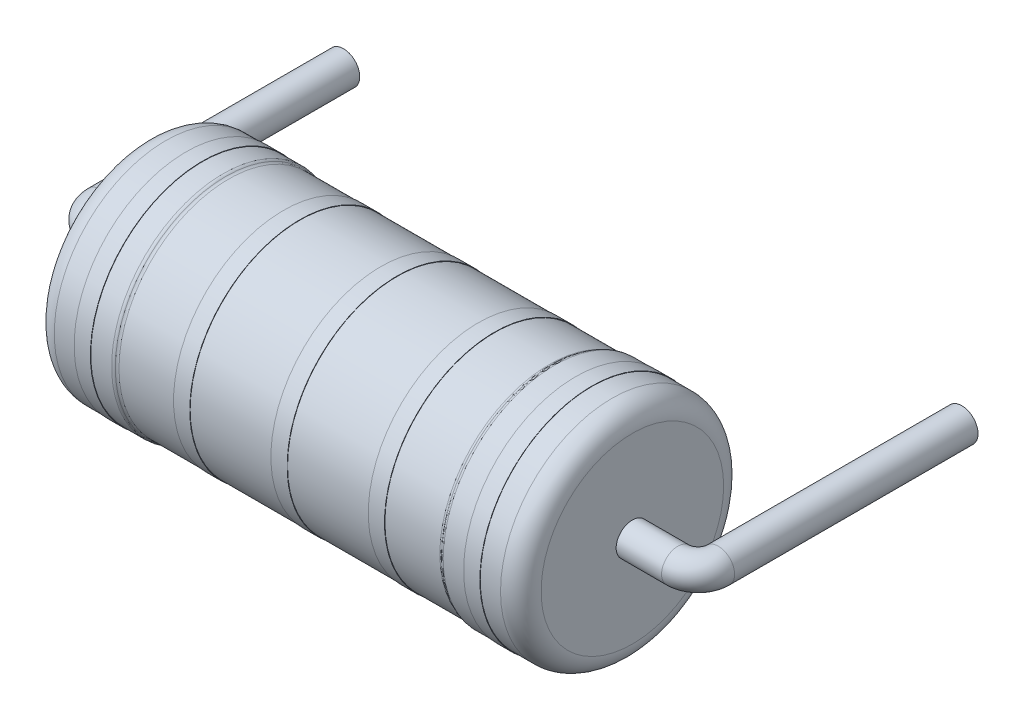
ISO-10303-21;
HEADER;
FILE_DESCRIPTION(('STEP AP214'),'2;1');
FILE_NAME('part.step','',(''),(''),'','','');
FILE_SCHEMA(('AUTOMOTIVE_DESIGN { 1 0 10303 214 1 1 1 1 }'));
ENDSEC;
DATA;
#1=APPLICATION_CONTEXT('core data for automotive mechanical design processes');
#2=APPLICATION_PROTOCOL_DEFINITION('international standard','automotive_design',2000,#1);
#3=PRODUCT_CONTEXT('',#1,'mechanical');
#4=PRODUCT('Part','Part','',(#3));
#5=PRODUCT_RELATED_PRODUCT_CATEGORY('part','',(#4));
#6=PRODUCT_DEFINITION_FORMATION('','',#4);
#7=PRODUCT_DEFINITION_CONTEXT('part definition',#1,'design');
#8=PRODUCT_DEFINITION('design','',#6,#7);
#9=PRODUCT_DEFINITION_SHAPE('','',#8);
#10=(LENGTH_UNIT() NAMED_UNIT(*) SI_UNIT(.MILLI.,.METRE.));
#11=(NAMED_UNIT(*) PLANE_ANGLE_UNIT() SI_UNIT($,.RADIAN.));
#12=(NAMED_UNIT(*) SI_UNIT($,.STERADIAN.) SOLID_ANGLE_UNIT());
#13=UNCERTAINTY_MEASURE_WITH_UNIT(LENGTH_MEASURE(1.E-05),#10,'distance_accuracy_value','');
#14=(GEOMETRIC_REPRESENTATION_CONTEXT(3) GLOBAL_UNCERTAINTY_ASSIGNED_CONTEXT((#13)) GLOBAL_UNIT_ASSIGNED_CONTEXT((#10,
#11,#12)) REPRESENTATION_CONTEXT('',''));
#15=CARTESIAN_POINT('',(0.,0.,0.));
#16=DIRECTION('',(0.,0.,1.));
#17=DIRECTION('',(1.,0.,0.));
#18=AXIS2_PLACEMENT_3D('',#15,#16,#17);
#19=CARTESIAN_POINT('',(0.2,0.,4.5));
#20=DIRECTION('',(-1.,0.,0.));
#21=DIRECTION('',(0.,0.,1.));
#22=AXIS2_PLACEMENT_3D('',#19,#20,#21);
#23=CYLINDRICAL_SURFACE('',#22,2.71);
#24=CARTESIAN_POINT('',(0.2,0.,4.5));
#25=DIRECTION('',(1.,0.,0.));
#26=DIRECTION('',(0.,0.,-1.));
#27=AXIS2_PLACEMENT_3D('',#24,#25,#26);
#28=CIRCLE('',#27,2.71);
#29=CARTESIAN_POINT('',(0.2,0.,1.79));
#30=VERTEX_POINT('',#29);
#31=EDGE_CURVE('E12',#30,#30,#28,.T.);
#32=ORIENTED_EDGE('',*,*,#31,.F.);
#33=EDGE_LOOP('',(#32));
#34=FACE_BOUND('',#33,.T.);
#35=CARTESIAN_POINT('',(-0.2,0.,4.5));
#36=DIRECTION('',(1.,0.,0.));
#37=DIRECTION('',(0.,0.,-1.));
#38=AXIS2_PLACEMENT_3D('',#35,#36,#37);
#39=CIRCLE('',#38,2.71);
#40=CARTESIAN_POINT('',(-0.2,0.,1.79));
#41=VERTEX_POINT('',#40);
#42=EDGE_CURVE('E40',#41,#41,#39,.T.);
#43=ORIENTED_EDGE('',*,*,#42,.T.);
#44=EDGE_LOOP('',(#43));
#45=FACE_BOUND('',#44,.T.);
#46=ADVANCED_FACE('F34',(#34,#45),#23,.T.);
#47=CARTESIAN_POINT('',(0.2,0.,4.5));
#48=DIRECTION('',(1.,0.,0.));
#49=DIRECTION('',(0.,0.,-1.));
#50=AXIS2_PLACEMENT_3D('',#47,#48,#49);
#51=PLANE('',#50);
#52=ORIENTED_EDGE('',*,*,#31,.T.);
#53=EDGE_LOOP('',(#52));
#54=FACE_BOUND('',#53,.T.);
#55=ADVANCED_FACE('F49',(#54),#51,.T.);
#56=CARTESIAN_POINT('',(-0.2,0.,4.5));
#57=DIRECTION('',(1.,0.,0.));
#58=DIRECTION('',(0.,0.,-1.));
#59=AXIS2_PLACEMENT_3D('',#56,#57,#58);
#60=PLANE('',#59);
#61=ORIENTED_EDGE('',*,*,#42,.F.);
#62=EDGE_LOOP('',(#61));
#63=FACE_BOUND('',#62,.T.);
#64=ADVANCED_FACE('F47',(#63),#60,.F.);
#65=CLOSED_SHELL('',(#46,#55,#64));
#66=MANIFOLD_SOLID_BREP('B2',#65);
#67=CARTESIAN_POINT('',(-2.2,0.,4.5));
#68=DIRECTION('',(-1.,0.,0.));
#69=DIRECTION('',(0.,0.,1.));
#70=AXIS2_PLACEMENT_3D('',#67,#68,#69);
#71=CYLINDRICAL_SURFACE('',#70,2.71);
#72=CARTESIAN_POINT('',(-2.2,0.,4.5));
#73=DIRECTION('',(1.,0.,0.));
#74=DIRECTION('',(0.,0.,-1.));
#75=AXIS2_PLACEMENT_3D('',#72,#73,#74);
#76=CIRCLE('',#75,2.71);
#77=CARTESIAN_POINT('',(-2.2,0.,1.79));
#78=VERTEX_POINT('',#77);
#79=EDGE_CURVE('E33',#78,#78,#76,.T.);
#80=ORIENTED_EDGE('',*,*,#79,.F.);
#81=EDGE_LOOP('',(#80));
#82=FACE_BOUND('',#81,.T.);
#83=CARTESIAN_POINT('',(-2.6,0.,4.5));
#84=DIRECTION('',(1.,0.,0.));
#85=DIRECTION('',(0.,0.,-1.));
#86=AXIS2_PLACEMENT_3D('',#83,#84,#85);
#87=CIRCLE('',#86,2.71);
#88=CARTESIAN_POINT('',(-2.6,0.,1.79));
#89=VERTEX_POINT('',#88);
#90=EDGE_CURVE('E82',#89,#89,#87,.T.);
#91=ORIENTED_EDGE('',*,*,#90,.T.);
#92=EDGE_LOOP('',(#91));
#93=FACE_BOUND('',#92,.T.);
#94=ADVANCED_FACE('F76',(#82,#93),#71,.T.);
#95=CARTESIAN_POINT('',(-2.2,0.,4.5));
#96=DIRECTION('',(1.,0.,0.));
#97=DIRECTION('',(0.,0.,-1.));
#98=AXIS2_PLACEMENT_3D('',#95,#96,#97);
#99=PLANE('',#98);
#100=ORIENTED_EDGE('',*,*,#79,.T.);
#101=EDGE_LOOP('',(#100));
#102=FACE_BOUND('',#101,.T.);
#103=ADVANCED_FACE('F91',(#102),#99,.T.);
#104=CARTESIAN_POINT('',(-2.6,0.,4.5));
#105=DIRECTION('',(1.,0.,0.));
#106=DIRECTION('',(0.,0.,-1.));
#107=AXIS2_PLACEMENT_3D('',#104,#105,#106);
#108=PLANE('',#107);
#109=ORIENTED_EDGE('',*,*,#90,.F.);
#110=EDGE_LOOP('',(#109));
#111=FACE_BOUND('',#110,.T.);
#112=ADVANCED_FACE('F89',(#111),#108,.F.);
#113=CLOSED_SHELL('',(#94,#103,#112));
#114=MANIFOLD_SOLID_BREP('B7',#113);
#115=CARTESIAN_POINT('',(2.6,0.,4.5));
#116=DIRECTION('',(-1.,0.,0.));
#117=DIRECTION('',(0.,0.,1.));
#118=AXIS2_PLACEMENT_3D('',#115,#116,#117);
#119=CYLINDRICAL_SURFACE('',#118,2.71);
#120=CARTESIAN_POINT('',(2.6,0.,4.5));
#121=DIRECTION('',(1.,0.,0.));
#122=DIRECTION('',(0.,0.,-1.));
#123=AXIS2_PLACEMENT_3D('',#120,#121,#122);
#124=CIRCLE('',#123,2.71);
#125=CARTESIAN_POINT('',(2.6,0.,1.79));
#126=VERTEX_POINT('',#125);
#127=EDGE_CURVE('E75',#126,#126,#124,.T.);
#128=ORIENTED_EDGE('',*,*,#127,.F.);
#129=EDGE_LOOP('',(#128));
#130=FACE_BOUND('',#129,.T.);
#131=CARTESIAN_POINT('',(2.2,0.,4.5));
#132=DIRECTION('',(1.,0.,0.));
#133=DIRECTION('',(0.,0.,-1.));
#134=AXIS2_PLACEMENT_3D('',#131,#132,#133);
#135=CIRCLE('',#134,2.71);
#136=CARTESIAN_POINT('',(2.2,0.,1.79));
#137=VERTEX_POINT('',#136);
#138=EDGE_CURVE('E124',#137,#137,#135,.T.);
#139=ORIENTED_EDGE('',*,*,#138,.T.);
#140=EDGE_LOOP('',(#139));
#141=FACE_BOUND('',#140,.T.);
#142=ADVANCED_FACE('F118',(#130,#141),#119,.T.);
#143=CARTESIAN_POINT('',(2.6,0.,4.5));
#144=DIRECTION('',(1.,0.,0.));
#145=DIRECTION('',(0.,0.,-1.));
#146=AXIS2_PLACEMENT_3D('',#143,#144,#145);
#147=PLANE('',#146);
#148=ORIENTED_EDGE('',*,*,#127,.T.);
#149=EDGE_LOOP('',(#148));
#150=FACE_BOUND('',#149,.T.);
#151=ADVANCED_FACE('F133',(#150),#147,.T.);
#152=CARTESIAN_POINT('',(2.2,0.,4.5));
#153=DIRECTION('',(1.,0.,0.));
#154=DIRECTION('',(0.,0.,-1.));
#155=AXIS2_PLACEMENT_3D('',#152,#153,#154);
#156=PLANE('',#155);
#157=ORIENTED_EDGE('',*,*,#138,.F.);
#158=EDGE_LOOP('',(#157));
#159=FACE_BOUND('',#158,.T.);
#160=ADVANCED_FACE('F131',(#159),#156,.F.);
#161=CLOSED_SHELL('',(#142,#151,#160));
#162=MANIFOLD_SOLID_BREP('B28',#161);
#163=CARTESIAN_POINT('',(-4.6,0.,4.5));
#164=DIRECTION('',(-1.,0.,0.));
#165=DIRECTION('',(0.,0.,1.));
#166=AXIS2_PLACEMENT_3D('',#163,#164,#165);
#167=CYLINDRICAL_SURFACE('',#166,2.76);
#168=CARTESIAN_POINT('',(-4.6,0.,4.5));
#169=DIRECTION('',(1.,0.,0.));
#170=DIRECTION('',(0.,0.,-1.));
#171=AXIS2_PLACEMENT_3D('',#168,#169,#170);
#172=CIRCLE('',#171,2.76);
#173=CARTESIAN_POINT('',(-4.6,0.,1.74));
#174=VERTEX_POINT('',#173);
#175=EDGE_CURVE('E117',#174,#174,#172,.T.);
#176=ORIENTED_EDGE('',*,*,#175,.F.);
#177=EDGE_LOOP('',(#176));
#178=FACE_BOUND('',#177,.T.);
#179=CARTESIAN_POINT('',(-5.,0.,4.5));
#180=DIRECTION('',(1.,0.,0.));
#181=DIRECTION('',(0.,0.,-1.));
#182=AXIS2_PLACEMENT_3D('',#179,#180,#181);
#183=CIRCLE('',#182,2.76);
#184=CARTESIAN_POINT('',(-5.,0.,1.74));
#185=VERTEX_POINT('',#184);
#186=EDGE_CURVE('E166',#185,#185,#183,.T.);
#187=ORIENTED_EDGE('',*,*,#186,.T.);
#188=EDGE_LOOP('',(#187));
#189=FACE_BOUND('',#188,.T.);
#190=ADVANCED_FACE('F160',(#178,#189),#167,.T.);
#191=CARTESIAN_POINT('',(-4.6,0.,4.5));
#192=DIRECTION('',(1.,0.,0.));
#193=DIRECTION('',(0.,0.,-1.));
#194=AXIS2_PLACEMENT_3D('',#191,#192,#193);
#195=PLANE('',#194);
#196=ORIENTED_EDGE('',*,*,#175,.T.);
#197=EDGE_LOOP('',(#196));
#198=FACE_BOUND('',#197,.T.);
#199=ADVANCED_FACE('F175',(#198),#195,.T.);
#200=CARTESIAN_POINT('',(-5.,0.,4.5));
#201=DIRECTION('',(1.,0.,0.));
#202=DIRECTION('',(0.,0.,-1.));
#203=AXIS2_PLACEMENT_3D('',#200,#201,#202);
#204=PLANE('',#203);
#205=ORIENTED_EDGE('',*,*,#186,.F.);
#206=EDGE_LOOP('',(#205));
#207=FACE_BOUND('',#206,.T.);
#208=ADVANCED_FACE('F173',(#207),#204,.F.);
#209=CLOSED_SHELL('',(#190,#199,#208));
#210=MANIFOLD_SOLID_BREP('B70',#209);
#211=CARTESIAN_POINT('',(5.,0.,4.5));
#212=DIRECTION('',(-1.,0.,0.));
#213=DIRECTION('',(0.,0.,1.));
#214=AXIS2_PLACEMENT_3D('',#211,#212,#213);
#215=CYLINDRICAL_SURFACE('',#214,2.76);
#216=CARTESIAN_POINT('',(5.,0.,4.5));
#217=DIRECTION('',(1.,0.,0.));
#218=DIRECTION('',(0.,0.,-1.));
#219=AXIS2_PLACEMENT_3D('',#216,#217,#218);
#220=CIRCLE('',#219,2.76);
#221=CARTESIAN_POINT('',(5.,0.,1.74));
#222=VERTEX_POINT('',#221);
#223=EDGE_CURVE('E159',#222,#222,#220,.T.);
#224=ORIENTED_EDGE('',*,*,#223,.F.);
#225=EDGE_LOOP('',(#224));
#226=FACE_BOUND('',#225,.T.);
#227=CARTESIAN_POINT('',(4.6,0.,4.5));
#228=DIRECTION('',(1.,0.,0.));
#229=DIRECTION('',(0.,0.,-1.));
#230=AXIS2_PLACEMENT_3D('',#227,#228,#229);
#231=CIRCLE('',#230,2.76);
#232=CARTESIAN_POINT('',(4.6,0.,1.74));
#233=VERTEX_POINT('',#232);
#234=EDGE_CURVE('E207',#233,#233,#231,.T.);
#235=ORIENTED_EDGE('',*,*,#234,.T.);
#236=EDGE_LOOP('',(#235));
#237=FACE_BOUND('',#236,.T.);
#238=ADVANCED_FACE('F201',(#226,#237),#215,.T.);
#239=CARTESIAN_POINT('',(5.,0.,4.5));
#240=DIRECTION('',(1.,0.,0.));
#241=DIRECTION('',(0.,0.,-1.));
#242=AXIS2_PLACEMENT_3D('',#239,#240,#241);
#243=PLANE('',#242);
#244=ORIENTED_EDGE('',*,*,#223,.T.);
#245=EDGE_LOOP('',(#244));
#246=FACE_BOUND('',#245,.T.);
#247=ADVANCED_FACE('F216',(#246),#243,.T.);
#248=CARTESIAN_POINT('',(4.6,0.,4.5));
#249=DIRECTION('',(1.,0.,0.));
#250=DIRECTION('',(0.,0.,-1.));
#251=AXIS2_PLACEMENT_3D('',#248,#249,#250);
#252=PLANE('',#251);
#253=ORIENTED_EDGE('',*,*,#234,.F.);
#254=EDGE_LOOP('',(#253));
#255=FACE_BOUND('',#254,.T.);
#256=ADVANCED_FACE('F214',(#255),#252,.F.);
#257=CLOSED_SHELL('',(#238,#247,#256));
#258=MANIFOLD_SOLID_BREP('B112',#257);
#259=CARTESIAN_POINT('',(6.,0.,4.5));
#260=DIRECTION('',(1.,0.,0.));
#261=DIRECTION('',(0.,0.,-1.));
#262=AXIS2_PLACEMENT_3D('',#259,#260,#261);
#263=PLANE('',#262);
#264=CARTESIAN_POINT('',(6.,0.,4.5));
#265=DIRECTION('',(1.,0.,0.));
#266=DIRECTION('',(0.,0.,-1.));
#267=AXIS2_PLACEMENT_3D('',#264,#265,#266);
#268=CIRCLE('',#267,2.25);
#269=CARTESIAN_POINT('',(6.,0.,2.25));
#270=VERTEX_POINT('',#269);
#271=EDGE_CURVE('E250',#270,#270,#268,.T.);
#272=ORIENTED_EDGE('',*,*,#271,.T.);
#273=EDGE_LOOP('',(#272));
#274=FACE_BOUND('',#273,.T.);
#275=CARTESIAN_POINT('',(6.,0.,4.5));
#276=DIRECTION('',(1.,0.,0.));
#277=DIRECTION('',(0.,0.,-1.));
#278=AXIS2_PLACEMENT_3D('',#275,#276,#277);
#279=CIRCLE('',#278,0.4);
#280=CARTESIAN_POINT('',(6.,0.,4.1));
#281=VERTEX_POINT('',#280);
#282=EDGE_CURVE('E294',#281,#281,#279,.T.);
#283=ORIENTED_EDGE('',*,*,#282,.F.);
#284=EDGE_LOOP('',(#283));
#285=FACE_BOUND('',#284,.T.);
#286=ADVANCED_FACE('F235',(#274,#285),#263,.T.);
#287=CARTESIAN_POINT('',(6.,0.,4.5));
#288=DIRECTION('',(-1.,0.,0.));
#289=DIRECTION('',(0.,0.,1.));
#290=AXIS2_PLACEMENT_3D('',#287,#288,#289);
#291=CYLINDRICAL_SURFACE('',#290,2.75);
#292=CARTESIAN_POINT('',(-5.5,0.,4.5));
#293=DIRECTION('',(1.,0.,0.));
#294=DIRECTION('',(0.,0.,-1.));
#295=AXIS2_PLACEMENT_3D('',#292,#293,#294);
#296=CIRCLE('',#295,2.75);
#297=CARTESIAN_POINT('',(-5.5,0.,1.75));
#298=VERTEX_POINT('',#297);
#299=EDGE_CURVE('E242',#298,#298,#296,.T.);
#300=ORIENTED_EDGE('',*,*,#299,.T.);
#301=EDGE_LOOP('',(#300));
#302=FACE_BOUND('',#301,.T.);
#303=CARTESIAN_POINT('',(-4.08660254037844,0.,4.5));
#304=DIRECTION('',(1.,0.,0.));
#305=DIRECTION('',(0.,0.,-1.));
#306=AXIS2_PLACEMENT_3D('',#303,#304,#305);
#307=CIRCLE('',#306,2.75);
#308=CARTESIAN_POINT('',(-4.08660254037844,0.,1.75));
#309=VERTEX_POINT('',#308);
#310=EDGE_CURVE('E270',#309,#309,#307,.F.);
#311=ORIENTED_EDGE('',*,*,#310,.T.);
#312=EDGE_LOOP('',(#311));
#313=FACE_BOUND('',#312,.T.);
#314=ADVANCED_FACE('F301',(#302,#313),#291,.T.);
#315=CARTESIAN_POINT('',(-6.,0.,4.5));
#316=DIRECTION('',(1.,0.,0.));
#317=DIRECTION('',(0.,0.,-1.));
#318=AXIS2_PLACEMENT_3D('',#315,#316,#317);
#319=PLANE('',#318);
#320=CARTESIAN_POINT('',(-6.,0.,4.5));
#321=DIRECTION('',(1.,0.,0.));
#322=DIRECTION('',(0.,0.,-1.));
#323=AXIS2_PLACEMENT_3D('',#320,#321,#322);
#324=CIRCLE('',#323,0.4);
#325=CARTESIAN_POINT('',(-6.,0.,4.1));
#326=VERTEX_POINT('',#325);
#327=EDGE_CURVE('E282',#326,#326,#324,.T.);
#328=ORIENTED_EDGE('',*,*,#327,.T.);
#329=EDGE_LOOP('',(#328));
#330=FACE_BOUND('',#329,.T.);
#331=CARTESIAN_POINT('',(-6.,0.,4.5));
#332=DIRECTION('',(1.,0.,0.));
#333=DIRECTION('',(0.,0.,-1.));
#334=AXIS2_PLACEMENT_3D('',#331,#332,#333);
#335=CIRCLE('',#334,2.25);
#336=CARTESIAN_POINT('',(-6.,0.,2.25));
#337=VERTEX_POINT('',#336);
#338=EDGE_CURVE('E200',#337,#337,#335,.F.);
#339=ORIENTED_EDGE('',*,*,#338,.T.);
#340=EDGE_LOOP('',(#339));
#341=FACE_BOUND('',#340,.T.);
#342=ADVANCED_FACE('F308',(#330,#341),#319,.F.);
#343=CARTESIAN_POINT('',(-4.,0.,4.5));
#344=DIRECTION('',(1.,0.,0.));
#345=DIRECTION('',(0.,0.,-1.));
#346=AXIS2_PLACEMENT_3D('',#343,#344,#345);
#347=CYLINDRICAL_SURFACE('',#346,2.7);
#348=CARTESIAN_POINT('',(-3.95431497482241,0.,4.5));
#349=DIRECTION('',(1.,0.,0.));
#350=DIRECTION('',(0.,0.,-1.));
#351=AXIS2_PLACEMENT_3D('',#348,#349,#350);
#352=CIRCLE('',#351,2.7);
#353=CARTESIAN_POINT('',(-3.95431497482241,0.,1.8));
#354=VERTEX_POINT('',#353);
#355=EDGE_CURVE('E261',#354,#354,#352,.T.);
#356=ORIENTED_EDGE('',*,*,#355,.T.);
#357=EDGE_LOOP('',(#356));
#358=FACE_BOUND('',#357,.T.);
#359=CARTESIAN_POINT('',(3.95431497482241,0.,4.5));
#360=DIRECTION('',(1.,0.,0.));
#361=DIRECTION('',(0.,0.,-1.));
#362=AXIS2_PLACEMENT_3D('',#359,#360,#361);
#363=CIRCLE('',#362,2.7);
#364=CARTESIAN_POINT('',(3.95431497482241,0.,1.8));
#365=VERTEX_POINT('',#364);
#366=EDGE_CURVE('E264',#365,#365,#363,.F.);
#367=ORIENTED_EDGE('',*,*,#366,.T.);
#368=EDGE_LOOP('',(#367));
#369=FACE_BOUND('',#368,.T.);
#370=ADVANCED_FACE('F312',(#358,#369),#347,.T.);
#371=CARTESIAN_POINT('',(5.5,0.,4.5));
#372=DIRECTION('',(1.,0.,0.));
#373=DIRECTION('',(0.,0.,-1.));
#374=AXIS2_PLACEMENT_3D('',#371,#372,#373);
#375=CIRCLE('',#374,2.75);
#376=CARTESIAN_POINT('',(5.5,0.,1.75));
#377=VERTEX_POINT('',#376);
#378=EDGE_CURVE('E246',#377,#377,#375,.F.);
#379=ORIENTED_EDGE('',*,*,#378,.T.);
#380=EDGE_LOOP('',(#379));
#381=FACE_BOUND('',#380,.T.);
#382=CARTESIAN_POINT('',(4.08660254037844,0.,4.5));
#383=DIRECTION('',(-1.,0.,0.));
#384=DIRECTION('',(0.,0.,1.));
#385=AXIS2_PLACEMENT_3D('',#382,#383,#384);
#386=CIRCLE('',#385,2.75);
#387=CARTESIAN_POINT('',(4.08660254037844,0.,7.25));
#388=VERTEX_POINT('',#387);
#389=EDGE_CURVE('E267',#388,#388,#386,.F.);
#390=ORIENTED_EDGE('',*,*,#389,.T.);
#391=EDGE_LOOP('',(#390));
#392=FACE_BOUND('',#391,.T.);
#393=ADVANCED_FACE('F237',(#381,#392),#291,.T.);
#394=CARTESIAN_POINT('',(-4.08660254037844,0.,4.5));
#395=DIRECTION('',(1.,0.,0.));
#396=DIRECTION('',(0.,0.,-1.));
#397=AXIS2_PLACEMENT_3D('',#394,#395,#396);
#398=TOROIDAL_SURFACE('',#397,2.65,0.1);
#399=CARTESIAN_POINT('',(-4.02045875760084,0.,4.5));
#400=DIRECTION('',(-1.,0.,0.));
#401=DIRECTION('',(0.,0.,1.));
#402=AXIS2_PLACEMENT_3D('',#399,#400,#401);
#403=CIRCLE('',#402,2.72499999999909);
#404=CARTESIAN_POINT('',(-4.02045875760084,0.,7.22499999999909));
#405=VERTEX_POINT('',#404);
#406=EDGE_CURVE('E258',#405,#405,#403,.T.);
#407=ORIENTED_EDGE('',*,*,#406,.T.);
#408=EDGE_LOOP('',(#407));
#409=FACE_BOUND('',#408,.T.);
#410=ORIENTED_EDGE('',*,*,#310,.F.);
#411=EDGE_LOOP('',(#410));
#412=FACE_BOUND('',#411,.T.);
#413=ADVANCED_FACE('F317',(#409,#412),#398,.T.);
#414=CARTESIAN_POINT('',(4.08660254037844,0.,4.5));
#415=DIRECTION('',(-1.,0.,0.));
#416=DIRECTION('',(0.,0.,1.));
#417=AXIS2_PLACEMENT_3D('',#414,#415,#416);
#418=TOROIDAL_SURFACE('',#417,2.65,0.1);
#419=CARTESIAN_POINT('',(4.02045875760084,0.,4.5));
#420=DIRECTION('',(1.,0.,0.));
#421=DIRECTION('',(0.,0.,-1.));
#422=AXIS2_PLACEMENT_3D('',#419,#420,#421);
#423=CIRCLE('',#422,2.72499999999909);
#424=CARTESIAN_POINT('',(4.02045875760084,0.,1.77500000000091));
#425=VERTEX_POINT('',#424);
#426=EDGE_CURVE('E255',#425,#425,#423,.T.);
#427=ORIENTED_EDGE('',*,*,#426,.T.);
#428=EDGE_LOOP('',(#427));
#429=FACE_BOUND('',#428,.T.);
#430=ORIENTED_EDGE('',*,*,#389,.F.);
#431=EDGE_LOOP('',(#430));
#432=FACE_BOUND('',#431,.T.);
#433=ADVANCED_FACE('F320',(#429,#432),#418,.T.);
#434=CARTESIAN_POINT('',(-3.95431497482241,0.,4.5));
#435=DIRECTION('',(1.,0.,0.));
#436=DIRECTION('',(0.,0.,-1.));
#437=AXIS2_PLACEMENT_3D('',#434,#435,#436);
#438=TOROIDAL_SURFACE('',#437,2.79999999999911,0.1);
#439=ORIENTED_EDGE('',*,*,#406,.F.);
#440=EDGE_LOOP('',(#439));
#441=FACE_BOUND('',#440,.T.);
#442=ORIENTED_EDGE('',*,*,#355,.F.);
#443=EDGE_LOOP('',(#442));
#444=FACE_BOUND('',#443,.T.);
#445=ADVANCED_FACE('F324',(#441,#444),#438,.F.);
#446=CARTESIAN_POINT('',(3.95431497482241,0.,4.5));
#447=DIRECTION('',(1.,0.,0.));
#448=DIRECTION('',(0.,0.,-1.));
#449=AXIS2_PLACEMENT_3D('',#446,#447,#448);
#450=TOROIDAL_SURFACE('',#449,2.79999999999911,0.1);
#451=ORIENTED_EDGE('',*,*,#366,.F.);
#452=EDGE_LOOP('',(#451));
#453=FACE_BOUND('',#452,.T.);
#454=ORIENTED_EDGE('',*,*,#426,.F.);
#455=EDGE_LOOP('',(#454));
#456=FACE_BOUND('',#455,.T.);
#457=ADVANCED_FACE('F328',(#453,#456),#450,.F.);
#458=CARTESIAN_POINT('',(5.5,0.,4.5));
#459=DIRECTION('',(1.,0.,0.));
#460=DIRECTION('',(0.,0.,-1.));
#461=AXIS2_PLACEMENT_3D('',#458,#459,#460);
#462=TOROIDAL_SURFACE('',#461,2.25,0.5);
#463=ORIENTED_EDGE('',*,*,#378,.F.);
#464=EDGE_LOOP('',(#463));
#465=FACE_BOUND('',#464,.T.);
#466=ORIENTED_EDGE('',*,*,#271,.F.);
#467=EDGE_LOOP('',(#466));
#468=FACE_BOUND('',#467,.T.);
#469=ADVANCED_FACE('F332',(#465,#468),#462,.T.);
#470=CARTESIAN_POINT('',(-5.5,0.,4.5));
#471=DIRECTION('',(1.,0.,0.));
#472=DIRECTION('',(0.,0.,-1.));
#473=AXIS2_PLACEMENT_3D('',#470,#471,#472);
#474=TOROIDAL_SURFACE('',#473,2.25,0.5);
#475=ORIENTED_EDGE('',*,*,#338,.F.);
#476=EDGE_LOOP('',(#475));
#477=FACE_BOUND('',#476,.T.);
#478=ORIENTED_EDGE('',*,*,#299,.F.);
#479=EDGE_LOOP('',(#478));
#480=FACE_BOUND('',#479,.T.);
#481=ADVANCED_FACE('F336',(#477,#480),#474,.T.);
#482=CARTESIAN_POINT('',(-7.62,0.,4.));
#483=DIRECTION('',(0.,0.,-1.));
#484=DIRECTION('',(-1.,0.,0.));
#485=AXIS2_PLACEMENT_3D('',#482,#483,#484);
#486=CYLINDRICAL_SURFACE('',#485,0.4);
#487=CARTESIAN_POINT('',(-7.62,0.,4.));
#488=DIRECTION('',(0.,0.,1.));
#489=DIRECTION('',(1.,0.,0.));
#490=AXIS2_PLACEMENT_3D('',#487,#488,#489);
#491=CIRCLE('',#490,0.4);
#492=CARTESIAN_POINT('',(-8.02,0.,4.));
#493=VERTEX_POINT('',#492);
#494=EDGE_CURVE('E276',#493,#493,#491,.T.);
#495=ORIENTED_EDGE('',*,*,#494,.F.);
#496=EDGE_LOOP('',(#495));
#497=FACE_BOUND('',#496,.T.);
#498=CARTESIAN_POINT('',(-7.62,0.,-2.));
#499=DIRECTION('',(0.,0.,1.));
#500=DIRECTION('',(1.,0.,0.));
#501=AXIS2_PLACEMENT_3D('',#498,#499,#500);
#502=CIRCLE('',#501,0.4);
#503=CARTESIAN_POINT('',(-7.22,0.,-2.));
#504=VERTEX_POINT('',#503);
#505=EDGE_CURVE('E273',#504,#504,#502,.T.);
#506=ORIENTED_EDGE('',*,*,#505,.T.);
#507=EDGE_LOOP('',(#506));
#508=FACE_BOUND('',#507,.T.);
#509=ADVANCED_FACE('F340',(#497,#508),#486,.T.);
#510=CARTESIAN_POINT('',(-7.12,0.,4.));
#511=DIRECTION('',(0.,-1.,0.));
#512=DIRECTION('',(0.,0.,-1.));
#513=AXIS2_PLACEMENT_3D('',#510,#511,#512);
#514=TOROIDAL_SURFACE('',#513,0.5,0.4);
#515=CARTESIAN_POINT('',(-7.12,0.,4.5));
#516=DIRECTION('',(1.,0.,0.));
#517=DIRECTION('',(0.,0.,-1.));
#518=AXIS2_PLACEMENT_3D('',#515,#516,#517);
#519=CIRCLE('',#518,0.4);
#520=CARTESIAN_POINT('',(-7.12,0.,4.9));
#521=VERTEX_POINT('',#520);
#522=EDGE_CURVE('E279',#521,#521,#519,.T.);
#523=CARTESIAN_POINT('',(-7.12,0.,4.));
#524=DIRECTION('',(0.,-1.,0.));
#525=DIRECTION('',(0.,0.,-1.));
#526=AXIS2_PLACEMENT_3D('',#523,#524,#525);
#527=CIRCLE('',#526,0.900000000000001);
#528=EDGE_CURVE('',#521,#493,#527,.T.);
#529=ORIENTED_EDGE('',*,*,#522,.F.);
#530=ORIENTED_EDGE('',*,*,#494,.T.);
#531=ORIENTED_EDGE('',*,*,#528,.T.);
#532=ORIENTED_EDGE('',*,*,#528,.F.);
#533=EDGE_LOOP('',(#529,#531,#530,#532));
#534=FACE_BOUND('',#533,.T.);
#535=ADVANCED_FACE('F344',(#534),#514,.T.);
#536=CARTESIAN_POINT('',(-7.12,0.,4.5));
#537=DIRECTION('',(1.,0.,0.));
#538=DIRECTION('',(0.,0.,-1.));
#539=AXIS2_PLACEMENT_3D('',#536,#537,#538);
#540=CYLINDRICAL_SURFACE('',#539,0.4);
#541=ORIENTED_EDGE('',*,*,#522,.T.);
#542=EDGE_LOOP('',(#541));
#543=FACE_BOUND('',#542,.T.);
#544=ORIENTED_EDGE('',*,*,#327,.F.);
#545=EDGE_LOOP('',(#544));
#546=FACE_BOUND('',#545,.T.);
#547=ADVANCED_FACE('F348',(#543,#546),#540,.T.);
#548=CARTESIAN_POINT('',(-7.62,0.,-2.));
#549=DIRECTION('',(0.,0.,1.));
#550=DIRECTION('',(1.,0.,0.));
#551=AXIS2_PLACEMENT_3D('',#548,#549,#550);
#552=PLANE('',#551);
#553=ORIENTED_EDGE('',*,*,#505,.F.);
#554=EDGE_LOOP('',(#553));
#555=FACE_BOUND('',#554,.T.);
#556=ADVANCED_FACE('F352',(#555),#552,.F.);
#557=CARTESIAN_POINT('',(7.62,0.,4.));
#558=DIRECTION('',(0.,0.,-1.));
#559=DIRECTION('',(-1.,0.,0.));
#560=AXIS2_PLACEMENT_3D('',#557,#558,#559);
#561=CYLINDRICAL_SURFACE('',#560,0.4);
#562=CARTESIAN_POINT('',(7.62,0.,4.));
#563=DIRECTION('',(0.,0.,-1.));
#564=DIRECTION('',(-1.,0.,0.));
#565=AXIS2_PLACEMENT_3D('',#562,#563,#564);
#566=CIRCLE('',#565,0.4);
#567=CARTESIAN_POINT('',(8.02,0.,4.));
#568=VERTEX_POINT('',#567);
#569=EDGE_CURVE('E288',#568,#568,#566,.T.);
#570=ORIENTED_EDGE('',*,*,#569,.T.);
#571=EDGE_LOOP('',(#570));
#572=FACE_BOUND('',#571,.T.);
#573=CARTESIAN_POINT('',(7.62,0.,-2.));
#574=DIRECTION('',(0.,0.,-1.));
#575=DIRECTION('',(-1.,0.,0.));
#576=AXIS2_PLACEMENT_3D('',#573,#574,#575);
#577=CIRCLE('',#576,0.4);
#578=CARTESIAN_POINT('',(7.22,0.,-2.));
#579=VERTEX_POINT('',#578);
#580=EDGE_CURVE('E285',#579,#579,#577,.T.);
#581=ORIENTED_EDGE('',*,*,#580,.F.);
#582=EDGE_LOOP('',(#581));
#583=FACE_BOUND('',#582,.T.);
#584=ADVANCED_FACE('F355',(#572,#583),#561,.T.);
#585=CARTESIAN_POINT('',(7.12,0.,4.));
#586=DIRECTION('',(0.,1.,0.));
#587=DIRECTION('',(0.,0.,1.));
#588=AXIS2_PLACEMENT_3D('',#585,#586,#587);
#589=TOROIDAL_SURFACE('',#588,0.5,0.4);
#590=CARTESIAN_POINT('',(7.12,0.,4.5));
#591=DIRECTION('',(1.,0.,0.));
#592=DIRECTION('',(0.,0.,-1.));
#593=AXIS2_PLACEMENT_3D('',#590,#591,#592);
#594=CIRCLE('',#593,0.4);
#595=CARTESIAN_POINT('',(7.12,0.,4.9));
#596=VERTEX_POINT('',#595);
#597=EDGE_CURVE('E291',#596,#596,#594,.T.);
#598=CARTESIAN_POINT('',(7.12,0.,4.));
#599=DIRECTION('',(0.,1.,0.));
#600=DIRECTION('',(0.,0.,1.));
#601=AXIS2_PLACEMENT_3D('',#598,#599,#600);
#602=CIRCLE('',#601,0.900000000000001);
#603=EDGE_CURVE('',#596,#568,#602,.T.);
#604=ORIENTED_EDGE('',*,*,#597,.T.);
#605=ORIENTED_EDGE('',*,*,#569,.F.);
#606=ORIENTED_EDGE('',*,*,#603,.T.);
#607=ORIENTED_EDGE('',*,*,#603,.F.);
#608=EDGE_LOOP('',(#604,#606,#605,#607));
#609=FACE_BOUND('',#608,.T.);
#610=ADVANCED_FACE('F358',(#609),#589,.T.);
#611=CARTESIAN_POINT('',(7.12,0.,4.5));
#612=DIRECTION('',(-1.,0.,0.));
#613=DIRECTION('',(0.,0.,1.));
#614=AXIS2_PLACEMENT_3D('',#611,#612,#613);
#615=CYLINDRICAL_SURFACE('',#614,0.4);
#616=ORIENTED_EDGE('',*,*,#597,.F.);
#617=EDGE_LOOP('',(#616));
#618=FACE_BOUND('',#617,.T.);
#619=ORIENTED_EDGE('',*,*,#282,.T.);
#620=EDGE_LOOP('',(#619));
#621=FACE_BOUND('',#620,.T.);
#622=ADVANCED_FACE('F298',(#618,#621),#615,.T.);
#623=CARTESIAN_POINT('',(7.62,0.,-2.));
#624=DIRECTION('',(0.,0.,1.));
#625=DIRECTION('',(-1.,0.,0.));
#626=AXIS2_PLACEMENT_3D('',#623,#624,#625);
#627=PLANE('',#626);
#628=ORIENTED_EDGE('',*,*,#580,.T.);
#629=EDGE_LOOP('',(#628));
#630=FACE_BOUND('',#629,.T.);
#631=ADVANCED_FACE('F365',(#630),#627,.F.);
#632=CLOSED_SHELL('',(#286,#314,#342,#370,#393,#413,#433,#445,#457,#469,#481,#509,#535,#547,
#556,#584,#610,#622,#631));
#633=MANIFOLD_SOLID_BREP('B154',#632);
#634=ADVANCED_BREP_SHAPE_REPRESENTATION('',(#18,#66,#114,#162,#210,#258,#633),#14);
#635=SHAPE_DEFINITION_REPRESENTATION(#9,#634);
ENDSEC;
END-ISO-10303-21;
